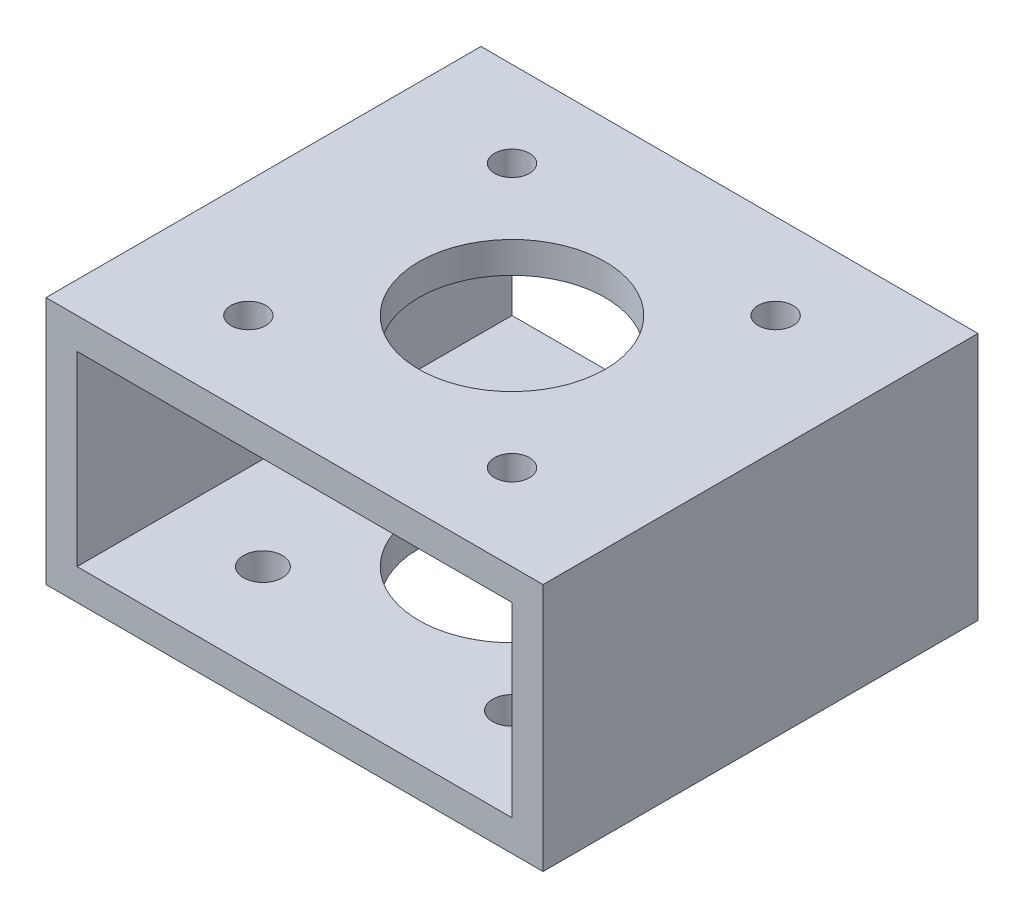
ISO-10303-21;
HEADER;
FILE_DESCRIPTION(('STEP AP214'),'2;1');
FILE_NAME('part.step','',(''),(''),'','','');
FILE_SCHEMA(('AUTOMOTIVE_DESIGN { 1 0 10303 214 1 1 1 1 }'));
ENDSEC;
DATA;
#1=APPLICATION_CONTEXT('core data for automotive mechanical design processes');
#2=APPLICATION_PROTOCOL_DEFINITION('international standard','automotive_design',2000,#1);
#3=PRODUCT_CONTEXT('',#1,'mechanical');
#4=PRODUCT('Part','Part','',(#3));
#5=PRODUCT_RELATED_PRODUCT_CATEGORY('part','',(#4));
#6=PRODUCT_DEFINITION_FORMATION('','',#4);
#7=PRODUCT_DEFINITION_CONTEXT('part definition',#1,'design');
#8=PRODUCT_DEFINITION('design','',#6,#7);
#9=PRODUCT_DEFINITION_SHAPE('','',#8);
#10=(LENGTH_UNIT() NAMED_UNIT(*) SI_UNIT(.MILLI.,.METRE.));
#11=(NAMED_UNIT(*) PLANE_ANGLE_UNIT() SI_UNIT($,.RADIAN.));
#12=(NAMED_UNIT(*) SI_UNIT($,.STERADIAN.) SOLID_ANGLE_UNIT());
#13=UNCERTAINTY_MEASURE_WITH_UNIT(LENGTH_MEASURE(1.E-05),#10,'distance_accuracy_value','');
#14=(GEOMETRIC_REPRESENTATION_CONTEXT(3) GLOBAL_UNCERTAINTY_ASSIGNED_CONTEXT((#13)) GLOBAL_UNIT_ASSIGNED_CONTEXT((#10,
#11,#12)) REPRESENTATION_CONTEXT('',''));
#15=CARTESIAN_POINT('',(0.,0.,0.));
#16=DIRECTION('',(0.,0.,1.));
#17=DIRECTION('',(1.,0.,0.));
#18=AXIS2_PLACEMENT_3D('',#15,#16,#17);
#19=CARTESIAN_POINT('',(0.,0.,0.));
#20=DIRECTION('',(0.,1.,0.));
#21=DIRECTION('',(-1.,0.,0.));
#22=AXIS2_PLACEMENT_3D('',#19,#20,#21);
#23=CYLINDRICAL_SURFACE('',#22,9.525);
#24=CARTESIAN_POINT('',(0.,3.175,0.));
#25=DIRECTION('',(0.,-1.,0.));
#26=DIRECTION('',(1.,0.,0.));
#27=AXIS2_PLACEMENT_3D('',#24,#25,#26);
#28=CIRCLE('',#27,9.525);
#29=CARTESIAN_POINT('',(9.525,3.175,0.));
#30=VERTEX_POINT('',#29);
#31=EDGE_CURVE('E45',#30,#30,#28,.F.);
#32=ORIENTED_EDGE('',*,*,#31,.T.);
#33=EDGE_LOOP('',(#32));
#34=FACE_BOUND('',#33,.T.);
#35=CARTESIAN_POINT('',(0.,0.,0.));
#36=DIRECTION('',(0.,1.,0.));
#37=DIRECTION('',(-1.,0.,0.));
#38=AXIS2_PLACEMENT_3D('',#35,#36,#37);
#39=CIRCLE('',#38,9.525);
#40=CARTESIAN_POINT('',(-9.525,0.,0.));
#41=VERTEX_POINT('',#40);
#42=EDGE_CURVE('E162',#41,#41,#39,.T.);
#43=ORIENTED_EDGE('',*,*,#42,.F.);
#44=EDGE_LOOP('',(#43));
#45=FACE_BOUND('',#44,.T.);
#46=ADVANCED_FACE('F41',(#34,#45),#23,.F.);
#47=CARTESIAN_POINT('',(-25.4,25.4,22.225));
#48=DIRECTION('',(1.,0.,0.));
#49=DIRECTION('',(0.,0.,-1.));
#50=AXIS2_PLACEMENT_3D('',#47,#48,#49);
#51=PLANE('',#50);
#52=DIRECTION('',(0.,-1.,0.));
#53=VECTOR('',#52,1.);
#54=CARTESIAN_POINT('',(-25.4,25.4,-22.225));
#55=LINE('',#54,#53);
#56=CARTESIAN_POINT('',(-25.4,25.4,-22.225));
#57=VERTEX_POINT('',#56);
#58=CARTESIAN_POINT('',(-25.4,0.,-22.225));
#59=VERTEX_POINT('',#58);
#60=EDGE_CURVE('E166',#57,#59,#55,.T.);
#61=ORIENTED_EDGE('',*,*,#60,.T.);
#62=DIRECTION('',(0.,0.,-1.));
#63=VECTOR('',#62,1.);
#64=CARTESIAN_POINT('',(-25.4,0.,22.225));
#65=LINE('',#64,#63);
#66=CARTESIAN_POINT('',(-25.4,0.,22.225));
#67=VERTEX_POINT('',#66);
#68=EDGE_CURVE('E11',#67,#59,#65,.T.);
#69=ORIENTED_EDGE('',*,*,#68,.F.);
#70=DIRECTION('',(0.,-1.,0.));
#71=VECTOR('',#70,1.);
#72=CARTESIAN_POINT('',(-25.4,25.4,22.225));
#73=LINE('',#72,#71);
#74=CARTESIAN_POINT('',(-25.4,25.4,22.225));
#75=VERTEX_POINT('',#74);
#76=EDGE_CURVE('E171',#75,#67,#73,.T.);
#77=ORIENTED_EDGE('',*,*,#76,.F.);
#78=DIRECTION('',(0.,0.,-1.));
#79=VECTOR('',#78,1.);
#80=CARTESIAN_POINT('',(-25.4,25.4,22.225));
#81=LINE('',#80,#79);
#82=EDGE_CURVE('E185',#75,#57,#81,.T.);
#83=ORIENTED_EDGE('',*,*,#82,.T.);
#84=EDGE_LOOP('',(#61,#69,#77,#83));
#85=FACE_BOUND('',#84,.T.);
#86=ADVANCED_FACE('F43',(#85),#51,.F.);
#87=CARTESIAN_POINT('',(-25.4,0.,22.225));
#88=DIRECTION('',(0.,1.,0.));
#89=DIRECTION('',(-1.,0.,0.));
#90=AXIS2_PLACEMENT_3D('',#87,#88,#89);
#91=PLANE('',#90);
#92=CARTESIAN_POINT('',(12.7279220613579,0.,-12.7279220613578));
#93=DIRECTION('',(0.,-1.,0.));
#94=DIRECTION('',(0.,0.,-1.));
#95=AXIS2_PLACEMENT_3D('',#92,#93,#94);
#96=CIRCLE('',#95,1.984375);
#97=CARTESIAN_POINT('',(12.7279220613579,0.,-14.7122970613578));
#98=VERTEX_POINT('',#97);
#99=EDGE_CURVE('E260',#98,#98,#96,.T.);
#100=ORIENTED_EDGE('',*,*,#99,.F.);
#101=EDGE_LOOP('',(#100));
#102=FACE_BOUND('',#101,.T.);
#103=CARTESIAN_POINT('',(-12.7279220613578,0.,-12.7279220613579));
#104=DIRECTION('',(0.,-1.,0.));
#105=DIRECTION('',(0.,0.,-1.));
#106=AXIS2_PLACEMENT_3D('',#103,#104,#105);
#107=CIRCLE('',#106,1.984375);
#108=CARTESIAN_POINT('',(-12.7279220613578,0.,-14.7122970613579));
#109=VERTEX_POINT('',#108);
#110=EDGE_CURVE('E264',#109,#109,#107,.T.);
#111=ORIENTED_EDGE('',*,*,#110,.F.);
#112=EDGE_LOOP('',(#111));
#113=FACE_BOUND('',#112,.T.);
#114=CARTESIAN_POINT('',(-12.7279220613579,0.,12.7279220613578));
#115=DIRECTION('',(0.,-1.,0.));
#116=DIRECTION('',(0.,0.,-1.));
#117=AXIS2_PLACEMENT_3D('',#114,#115,#116);
#118=CIRCLE('',#117,1.984375);
#119=CARTESIAN_POINT('',(-12.7279220613579,0.,10.7435470613578));
#120=VERTEX_POINT('',#119);
#121=EDGE_CURVE('E268',#120,#120,#118,.T.);
#122=ORIENTED_EDGE('',*,*,#121,.F.);
#123=EDGE_LOOP('',(#122));
#124=FACE_BOUND('',#123,.T.);
#125=CARTESIAN_POINT('',(12.7279220613578,0.,12.7279220613579));
#126=DIRECTION('',(0.,-1.,0.));
#127=DIRECTION('',(0.,0.,-1.));
#128=AXIS2_PLACEMENT_3D('',#125,#126,#127);
#129=CIRCLE('',#128,1.984375);
#130=CARTESIAN_POINT('',(12.7279220613578,0.,10.7435470613579));
#131=VERTEX_POINT('',#130);
#132=EDGE_CURVE('E272',#131,#131,#129,.T.);
#133=ORIENTED_EDGE('',*,*,#132,.F.);
#134=EDGE_LOOP('',(#133));
#135=FACE_BOUND('',#134,.T.);
#136=ORIENTED_EDGE('',*,*,#42,.T.);
#137=EDGE_LOOP('',(#136));
#138=FACE_BOUND('',#137,.T.);
#139=DIRECTION('',(1.,0.,0.));
#140=VECTOR('',#139,1.);
#141=CARTESIAN_POINT('',(-25.4,0.,-22.225));
#142=LINE('',#141,#140);
#143=CARTESIAN_POINT('',(25.4,0.,-22.225));
#144=VERTEX_POINT('',#143);
#145=EDGE_CURVE('E189',#59,#144,#142,.T.);
#146=ORIENTED_EDGE('',*,*,#145,.T.);
#147=DIRECTION('',(0.,0.,-1.));
#148=VECTOR('',#147,1.);
#149=CARTESIAN_POINT('',(25.4,0.,22.225));
#150=LINE('',#149,#148);
#151=CARTESIAN_POINT('',(25.4,0.,22.225));
#152=VERTEX_POINT('',#151);
#153=EDGE_CURVE('E51',#152,#144,#150,.T.);
#154=ORIENTED_EDGE('',*,*,#153,.F.);
#155=DIRECTION('',(1.,0.,0.));
#156=VECTOR('',#155,1.);
#157=CARTESIAN_POINT('',(-25.4,0.,22.225));
#158=LINE('',#157,#156);
#159=EDGE_CURVE('E175',#67,#152,#158,.T.);
#160=ORIENTED_EDGE('',*,*,#159,.F.);
#161=ORIENTED_EDGE('',*,*,#68,.T.);
#162=EDGE_LOOP('',(#146,#154,#160,#161));
#163=FACE_BOUND('',#162,.T.);
#164=ADVANCED_FACE('F237',(#102,#113,#124,#135,#138,#163),#91,.F.);
#165=CARTESIAN_POINT('',(25.4,25.4,22.225));
#166=DIRECTION('',(-1.,0.,0.));
#167=DIRECTION('',(0.,-1.,0.));
#168=AXIS2_PLACEMENT_3D('',#165,#166,#167);
#169=PLANE('',#168);
#170=DIRECTION('',(0.,1.,0.));
#171=VECTOR('',#170,1.);
#172=CARTESIAN_POINT('',(25.4,25.4,-22.225));
#173=LINE('',#172,#171);
#174=CARTESIAN_POINT('',(25.4,25.4,-22.225));
#175=VERTEX_POINT('',#174);
#176=EDGE_CURVE('E192',#144,#175,#173,.T.);
#177=ORIENTED_EDGE('',*,*,#176,.T.);
#178=DIRECTION('',(0.,0.,-1.));
#179=VECTOR('',#178,1.);
#180=CARTESIAN_POINT('',(25.4,25.4,22.225));
#181=LINE('',#180,#179);
#182=CARTESIAN_POINT('',(25.4,25.4,22.225));
#183=VERTEX_POINT('',#182);
#184=EDGE_CURVE('E200',#183,#175,#181,.T.);
#185=ORIENTED_EDGE('',*,*,#184,.F.);
#186=DIRECTION('',(0.,1.,0.));
#187=VECTOR('',#186,1.);
#188=CARTESIAN_POINT('',(25.4,25.4,22.225));
#189=LINE('',#188,#187);
#190=EDGE_CURVE('E179',#152,#183,#189,.T.);
#191=ORIENTED_EDGE('',*,*,#190,.F.);
#192=ORIENTED_EDGE('',*,*,#153,.T.);
#193=EDGE_LOOP('',(#177,#185,#191,#192));
#194=FACE_BOUND('',#193,.T.);
#195=ADVANCED_FACE('F249',(#194),#169,.F.);
#196=CARTESIAN_POINT('',(-25.4,25.4,22.225));
#197=DIRECTION('',(0.,-1.,0.));
#198=DIRECTION('',(1.,0.,0.));
#199=AXIS2_PLACEMENT_3D('',#196,#197,#198);
#200=PLANE('',#199);
#201=CARTESIAN_POINT('',(-13.4703841816038,25.4,-13.4703841816037));
#202=DIRECTION('',(0.,1.,0.));
#203=DIRECTION('',(0.,0.,1.));
#204=AXIS2_PLACEMENT_3D('',#201,#202,#203);
#205=CIRCLE('',#204,1.786001);
#206=CARTESIAN_POINT('',(-13.4703841816038,25.4,-11.6843831816037));
#207=VERTEX_POINT('',#206);
#208=EDGE_CURVE('E295',#207,#207,#205,.T.);
#209=ORIENTED_EDGE('',*,*,#208,.F.);
#210=EDGE_LOOP('',(#209));
#211=FACE_BOUND('',#210,.T.);
#212=CARTESIAN_POINT('',(13.4703841816037,25.4,-13.4703841816038));
#213=DIRECTION('',(0.,1.,0.));
#214=DIRECTION('',(0.,0.,1.));
#215=AXIS2_PLACEMENT_3D('',#212,#213,#214);
#216=CIRCLE('',#215,1.786001);
#217=CARTESIAN_POINT('',(13.4703841816037,25.4,-11.6843831816038));
#218=VERTEX_POINT('',#217);
#219=EDGE_CURVE('E308',#218,#218,#216,.T.);
#220=ORIENTED_EDGE('',*,*,#219,.F.);
#221=EDGE_LOOP('',(#220));
#222=FACE_BOUND('',#221,.T.);
#223=CARTESIAN_POINT('',(13.4703841816038,25.4,13.4703841816037));
#224=DIRECTION('',(0.,1.,0.));
#225=DIRECTION('',(0.,0.,1.));
#226=AXIS2_PLACEMENT_3D('',#223,#224,#225);
#227=CIRCLE('',#226,1.786001);
#228=CARTESIAN_POINT('',(13.4703841816038,25.4,15.2563851816037));
#229=VERTEX_POINT('',#228);
#230=EDGE_CURVE('E316',#229,#229,#227,.T.);
#231=ORIENTED_EDGE('',*,*,#230,.F.);
#232=EDGE_LOOP('',(#231));
#233=FACE_BOUND('',#232,.T.);
#234=CARTESIAN_POINT('',(-13.4703841816037,25.4,13.4703841816038));
#235=DIRECTION('',(0.,1.,0.));
#236=DIRECTION('',(0.,0.,1.));
#237=AXIS2_PLACEMENT_3D('',#234,#235,#236);
#238=CIRCLE('',#237,1.786001);
#239=CARTESIAN_POINT('',(-13.4703841816037,25.4,15.2563851816038));
#240=VERTEX_POINT('',#239);
#241=EDGE_CURVE('E323',#240,#240,#238,.T.);
#242=ORIENTED_EDGE('',*,*,#241,.F.);
#243=EDGE_LOOP('',(#242));
#244=FACE_BOUND('',#243,.T.);
#245=CARTESIAN_POINT('',(0.,25.4,0.));
#246=DIRECTION('',(0.,1.,0.));
#247=DIRECTION('',(-1.,0.,0.));
#248=AXIS2_PLACEMENT_3D('',#245,#246,#247);
#249=CIRCLE('',#248,9.525);
#250=CARTESIAN_POINT('',(-9.52500000000001,25.4,0.));
#251=VERTEX_POINT('',#250);
#252=EDGE_CURVE('E167',#251,#251,#249,.T.);
#253=ORIENTED_EDGE('',*,*,#252,.F.);
#254=EDGE_LOOP('',(#253));
#255=FACE_BOUND('',#254,.T.);
#256=DIRECTION('',(-1.,0.,0.));
#257=VECTOR('',#256,1.);
#258=CARTESIAN_POINT('',(-25.4,25.4,-22.225));
#259=LINE('',#258,#257);
#260=EDGE_CURVE('E176',#175,#57,#259,.T.);
#261=ORIENTED_EDGE('',*,*,#260,.T.);
#262=ORIENTED_EDGE('',*,*,#82,.F.);
#263=DIRECTION('',(-1.,0.,0.));
#264=VECTOR('',#263,1.);
#265=CARTESIAN_POINT('',(-25.4,25.4,22.225));
#266=LINE('',#265,#264);
#267=EDGE_CURVE('E182',#183,#75,#266,.T.);
#268=ORIENTED_EDGE('',*,*,#267,.F.);
#269=ORIENTED_EDGE('',*,*,#184,.T.);
#270=EDGE_LOOP('',(#261,#262,#268,#269));
#271=FACE_BOUND('',#270,.T.);
#272=ADVANCED_FACE('F243',(#211,#222,#233,#244,#255,#271),#200,.F.);
#273=CARTESIAN_POINT('',(0.,0.,22.225));
#274=DIRECTION('',(0.,0.,1.));
#275=DIRECTION('',(1.,0.,0.));
#276=AXIS2_PLACEMENT_3D('',#273,#274,#275);
#277=PLANE('',#276);
#278=DIRECTION('',(0.,1.,0.));
#279=VECTOR('',#278,1.);
#280=CARTESIAN_POINT('',(-22.225,3.175,22.225));
#281=LINE('',#280,#279);
#282=CARTESIAN_POINT('',(-22.225,3.175,22.225));
#283=VERTEX_POINT('',#282);
#284=CARTESIAN_POINT('',(-22.225,22.225,22.225));
#285=VERTEX_POINT('',#284);
#286=EDGE_CURVE('E111',#283,#285,#281,.T.);
#287=ORIENTED_EDGE('',*,*,#286,.T.);
#288=DIRECTION('',(1.,0.,0.));
#289=VECTOR('',#288,1.);
#290=CARTESIAN_POINT('',(-22.225,22.225,22.225));
#291=LINE('',#290,#289);
#292=CARTESIAN_POINT('',(22.225,22.225,22.225));
#293=VERTEX_POINT('',#292);
#294=EDGE_CURVE('E121',#285,#293,#291,.T.);
#295=ORIENTED_EDGE('',*,*,#294,.T.);
#296=DIRECTION('',(0.,-1.,0.));
#297=VECTOR('',#296,1.);
#298=CARTESIAN_POINT('',(22.225,3.17499999999999,22.225));
#299=LINE('',#298,#297);
#300=CARTESIAN_POINT('',(22.225,3.17499999999999,22.225));
#301=VERTEX_POINT('',#300);
#302=EDGE_CURVE('E59',#293,#301,#299,.T.);
#303=ORIENTED_EDGE('',*,*,#302,.T.);
#304=DIRECTION('',(-1.,0.,0.));
#305=VECTOR('',#304,1.);
#306=CARTESIAN_POINT('',(-22.225,3.175,22.225));
#307=LINE('',#306,#305);
#308=EDGE_CURVE('E118',#301,#283,#307,.T.);
#309=ORIENTED_EDGE('',*,*,#308,.T.);
#310=EDGE_LOOP('',(#287,#295,#303,#309));
#311=FACE_BOUND('',#310,.T.);
#312=ORIENTED_EDGE('',*,*,#76,.T.);
#313=ORIENTED_EDGE('',*,*,#159,.T.);
#314=ORIENTED_EDGE('',*,*,#190,.T.);
#315=ORIENTED_EDGE('',*,*,#267,.T.);
#316=EDGE_LOOP('',(#312,#313,#314,#315));
#317=FACE_BOUND('',#316,.T.);
#318=ADVANCED_FACE('F127',(#311,#317),#277,.T.);
#319=CARTESIAN_POINT('',(0.,0.,-22.225));
#320=DIRECTION('',(0.,0.,1.));
#321=DIRECTION('',(1.,0.,0.));
#322=AXIS2_PLACEMENT_3D('',#319,#320,#321);
#323=PLANE('',#322);
#324=DIRECTION('',(1.,0.,0.));
#325=VECTOR('',#324,1.);
#326=CARTESIAN_POINT('',(-22.225,22.225,-22.225));
#327=LINE('',#326,#325);
#328=CARTESIAN_POINT('',(-22.225,22.225,-22.225));
#329=VERTEX_POINT('',#328);
#330=CARTESIAN_POINT('',(22.225,22.225,-22.225));
#331=VERTEX_POINT('',#330);
#332=EDGE_CURVE('E147',#329,#331,#327,.T.);
#333=ORIENTED_EDGE('',*,*,#332,.F.);
#334=DIRECTION('',(0.,1.,0.));
#335=VECTOR('',#334,1.);
#336=CARTESIAN_POINT('',(-22.225,3.175,-22.225));
#337=LINE('',#336,#335);
#338=CARTESIAN_POINT('',(-22.225,3.175,-22.225));
#339=VERTEX_POINT('',#338);
#340=EDGE_CURVE('E67',#339,#329,#337,.T.);
#341=ORIENTED_EDGE('',*,*,#340,.F.);
#342=DIRECTION('',(-1.,0.,0.));
#343=VECTOR('',#342,1.);
#344=CARTESIAN_POINT('',(-22.225,3.175,-22.225));
#345=LINE('',#344,#343);
#346=CARTESIAN_POINT('',(22.225,3.17499999999999,-22.225));
#347=VERTEX_POINT('',#346);
#348=EDGE_CURVE('E131',#347,#339,#345,.T.);
#349=ORIENTED_EDGE('',*,*,#348,.F.);
#350=DIRECTION('',(0.,-1.,0.));
#351=VECTOR('',#350,1.);
#352=CARTESIAN_POINT('',(22.225,3.17499999999999,-22.225));
#353=LINE('',#352,#351);
#354=EDGE_CURVE('E135',#331,#347,#353,.T.);
#355=ORIENTED_EDGE('',*,*,#354,.F.);
#356=EDGE_LOOP('',(#333,#341,#349,#355));
#357=FACE_BOUND('',#356,.T.);
#358=ORIENTED_EDGE('',*,*,#60,.F.);
#359=ORIENTED_EDGE('',*,*,#260,.F.);
#360=ORIENTED_EDGE('',*,*,#176,.F.);
#361=ORIENTED_EDGE('',*,*,#145,.F.);
#362=EDGE_LOOP('',(#358,#359,#360,#361));
#363=FACE_BOUND('',#362,.T.);
#364=ADVANCED_FACE('F227',(#357,#363),#323,.F.);
#365=CARTESIAN_POINT('',(0.,22.225,0.));
#366=DIRECTION('',(0.,1.,0.));
#367=DIRECTION('',(-1.,0.,0.));
#368=AXIS2_PLACEMENT_3D('',#365,#366,#367);
#369=CIRCLE('',#368,9.525);
#370=CARTESIAN_POINT('',(-9.52500000000001,22.225,0.));
#371=VERTEX_POINT('',#370);
#372=EDGE_CURVE('E156',#371,#371,#369,.F.);
#373=ORIENTED_EDGE('',*,*,#372,.T.);
#374=EDGE_LOOP('',(#373));
#375=FACE_BOUND('',#374,.T.);
#376=ORIENTED_EDGE('',*,*,#252,.T.);
#377=EDGE_LOOP('',(#376));
#378=FACE_BOUND('',#377,.T.);
#379=ADVANCED_FACE('F218',(#375,#378),#23,.F.);
#380=CARTESIAN_POINT('',(-22.225,3.175,22.225));
#381=DIRECTION('',(0.,-1.,0.));
#382=DIRECTION('',(1.,0.,0.));
#383=AXIS2_PLACEMENT_3D('',#380,#381,#382);
#384=PLANE('',#383);
#385=CARTESIAN_POINT('',(12.7279220613579,3.175,-12.7279220613578));
#386=DIRECTION('',(0.,-1.,0.));
#387=DIRECTION('',(1.,0.,0.));
#388=AXIS2_PLACEMENT_3D('',#385,#386,#387);
#389=CIRCLE('',#388,1.984375);
#390=CARTESIAN_POINT('',(14.7122970613579,3.17499999999999,-12.7279220613578));
#391=VERTEX_POINT('',#390);
#392=EDGE_CURVE('E371',#391,#391,#389,.T.);
#393=ORIENTED_EDGE('',*,*,#392,.T.);
#394=EDGE_LOOP('',(#393));
#395=FACE_BOUND('',#394,.T.);
#396=CARTESIAN_POINT('',(-12.7279220613578,3.175,-12.7279220613579));
#397=DIRECTION('',(0.,-1.,0.));
#398=DIRECTION('',(1.,0.,0.));
#399=AXIS2_PLACEMENT_3D('',#396,#397,#398);
#400=CIRCLE('',#399,1.984375);
#401=CARTESIAN_POINT('',(-10.7435470613578,3.175,-12.7279220613579));
#402=VERTEX_POINT('',#401);
#403=EDGE_CURVE('E379',#402,#402,#400,.T.);
#404=ORIENTED_EDGE('',*,*,#403,.T.);
#405=EDGE_LOOP('',(#404));
#406=FACE_BOUND('',#405,.T.);
#407=CARTESIAN_POINT('',(-12.7279220613579,3.175,12.7279220613578));
#408=DIRECTION('',(0.,-1.,0.));
#409=DIRECTION('',(1.,0.,0.));
#410=AXIS2_PLACEMENT_3D('',#407,#408,#409);
#411=CIRCLE('',#410,1.984375);
#412=CARTESIAN_POINT('',(-10.7435470613579,3.175,12.7279220613578));
#413=VERTEX_POINT('',#412);
#414=EDGE_CURVE('E290',#413,#413,#411,.T.);
#415=ORIENTED_EDGE('',*,*,#414,.T.);
#416=EDGE_LOOP('',(#415));
#417=FACE_BOUND('',#416,.T.);
#418=CARTESIAN_POINT('',(12.7279220613578,3.175,12.7279220613579));
#419=DIRECTION('',(0.,-1.,0.));
#420=DIRECTION('',(1.,0.,0.));
#421=AXIS2_PLACEMENT_3D('',#418,#419,#420);
#422=CIRCLE('',#421,1.984375);
#423=CARTESIAN_POINT('',(14.7122970613578,3.17499999999999,12.7279220613579));
#424=VERTEX_POINT('',#423);
#425=EDGE_CURVE('E289',#424,#424,#422,.T.);
#426=ORIENTED_EDGE('',*,*,#425,.T.);
#427=EDGE_LOOP('',(#426));
#428=FACE_BOUND('',#427,.T.);
#429=ORIENTED_EDGE('',*,*,#348,.T.);
#430=DIRECTION('',(0.,0.,-1.));
#431=VECTOR('',#430,1.);
#432=CARTESIAN_POINT('',(-22.225,3.175,22.225));
#433=LINE('',#432,#431);
#434=EDGE_CURVE('E153',#283,#339,#433,.T.);
#435=ORIENTED_EDGE('',*,*,#434,.F.);
#436=ORIENTED_EDGE('',*,*,#308,.F.);
#437=DIRECTION('',(0.,0.,-1.));
#438=VECTOR('',#437,1.);
#439=CARTESIAN_POINT('',(22.225,3.17499999999999,22.225));
#440=LINE('',#439,#438);
#441=EDGE_CURVE('E157',#301,#347,#440,.T.);
#442=ORIENTED_EDGE('',*,*,#441,.T.);
#443=EDGE_LOOP('',(#429,#435,#436,#442));
#444=FACE_BOUND('',#443,.T.);
#445=ORIENTED_EDGE('',*,*,#31,.F.);
#446=EDGE_LOOP('',(#445));
#447=FACE_BOUND('',#446,.T.);
#448=ADVANCED_FACE('F216',(#395,#406,#417,#428,#444,#447),#384,.F.);
#449=CARTESIAN_POINT('',(-22.225,22.225,22.225));
#450=DIRECTION('',(0.,1.,0.));
#451=DIRECTION('',(-1.,0.,0.));
#452=AXIS2_PLACEMENT_3D('',#449,#450,#451);
#453=PLANE('',#452);
#454=CARTESIAN_POINT('',(-13.4703841816038,22.225,-13.4703841816037));
#455=DIRECTION('',(0.,1.,0.));
#456=DIRECTION('',(-1.,0.,0.));
#457=AXIS2_PLACEMENT_3D('',#454,#455,#456);
#458=CIRCLE('',#457,1.786001);
#459=CARTESIAN_POINT('',(-15.2563851816038,22.225,-13.4703841816037));
#460=VERTEX_POINT('',#459);
#461=EDGE_CURVE('E304',#460,#460,#458,.T.);
#462=ORIENTED_EDGE('',*,*,#461,.T.);
#463=EDGE_LOOP('',(#462));
#464=FACE_BOUND('',#463,.T.);
#465=CARTESIAN_POINT('',(13.4703841816037,22.225,-13.4703841816038));
#466=DIRECTION('',(0.,1.,0.));
#467=DIRECTION('',(-1.,0.,0.));
#468=AXIS2_PLACEMENT_3D('',#465,#466,#467);
#469=CIRCLE('',#468,1.786001);
#470=CARTESIAN_POINT('',(11.6843831816037,22.225,-13.4703841816038));
#471=VERTEX_POINT('',#470);
#472=EDGE_CURVE('E312',#471,#471,#469,.T.);
#473=ORIENTED_EDGE('',*,*,#472,.T.);
#474=EDGE_LOOP('',(#473));
#475=FACE_BOUND('',#474,.T.);
#476=CARTESIAN_POINT('',(13.4703841816038,22.225,13.4703841816037));
#477=DIRECTION('',(0.,1.,0.));
#478=DIRECTION('',(-1.,0.,0.));
#479=AXIS2_PLACEMENT_3D('',#476,#477,#478);
#480=CIRCLE('',#479,1.786001);
#481=CARTESIAN_POINT('',(11.6843831816038,22.225,13.4703841816037));
#482=VERTEX_POINT('',#481);
#483=EDGE_CURVE('E320',#482,#482,#480,.T.);
#484=ORIENTED_EDGE('',*,*,#483,.T.);
#485=EDGE_LOOP('',(#484));
#486=FACE_BOUND('',#485,.T.);
#487=CARTESIAN_POINT('',(-13.4703841816037,22.225,13.4703841816038));
#488=DIRECTION('',(0.,1.,0.));
#489=DIRECTION('',(-1.,0.,0.));
#490=AXIS2_PLACEMENT_3D('',#487,#488,#489);
#491=CIRCLE('',#490,1.786001);
#492=CARTESIAN_POINT('',(-15.2563851816037,22.225,13.4703841816038));
#493=VERTEX_POINT('',#492);
#494=EDGE_CURVE('E138',#493,#493,#491,.T.);
#495=ORIENTED_EDGE('',*,*,#494,.T.);
#496=EDGE_LOOP('',(#495));
#497=FACE_BOUND('',#496,.T.);
#498=ORIENTED_EDGE('',*,*,#332,.T.);
#499=DIRECTION('',(0.,0.,-1.));
#500=VECTOR('',#499,1.);
#501=CARTESIAN_POINT('',(22.225,22.225,22.225));
#502=LINE('',#501,#500);
#503=EDGE_CURVE('E117',#293,#331,#502,.T.);
#504=ORIENTED_EDGE('',*,*,#503,.F.);
#505=ORIENTED_EDGE('',*,*,#294,.F.);
#506=DIRECTION('',(0.,0.,-1.));
#507=VECTOR('',#506,1.);
#508=CARTESIAN_POINT('',(-22.225,22.225,22.225));
#509=LINE('',#508,#507);
#510=EDGE_CURVE('E107',#285,#329,#509,.T.);
#511=ORIENTED_EDGE('',*,*,#510,.T.);
#512=EDGE_LOOP('',(#498,#504,#505,#511));
#513=FACE_BOUND('',#512,.T.);
#514=ORIENTED_EDGE('',*,*,#372,.F.);
#515=EDGE_LOOP('',(#514));
#516=FACE_BOUND('',#515,.T.);
#517=ADVANCED_FACE('F122',(#464,#475,#486,#497,#513,#516),#453,.F.);
#518=CARTESIAN_POINT('',(-22.225,3.175,22.225));
#519=DIRECTION('',(-1.,0.,0.));
#520=DIRECTION('',(0.,0.,1.));
#521=AXIS2_PLACEMENT_3D('',#518,#519,#520);
#522=PLANE('',#521);
#523=ORIENTED_EDGE('',*,*,#340,.T.);
#524=ORIENTED_EDGE('',*,*,#510,.F.);
#525=ORIENTED_EDGE('',*,*,#286,.F.);
#526=ORIENTED_EDGE('',*,*,#434,.T.);
#527=EDGE_LOOP('',(#523,#524,#525,#526));
#528=FACE_BOUND('',#527,.T.);
#529=ADVANCED_FACE('F109',(#528),#522,.F.);
#530=CARTESIAN_POINT('',(22.225,3.17499999999999,22.225));
#531=DIRECTION('',(1.,0.,0.));
#532=DIRECTION('',(0.,0.,-1.));
#533=AXIS2_PLACEMENT_3D('',#530,#531,#532);
#534=PLANE('',#533);
#535=ORIENTED_EDGE('',*,*,#354,.T.);
#536=ORIENTED_EDGE('',*,*,#441,.F.);
#537=ORIENTED_EDGE('',*,*,#302,.F.);
#538=ORIENTED_EDGE('',*,*,#503,.T.);
#539=EDGE_LOOP('',(#535,#536,#537,#538));
#540=FACE_BOUND('',#539,.T.);
#541=ADVANCED_FACE('F336',(#540),#534,.F.);
#542=CARTESIAN_POINT('',(-13.4703841816037,25.4,13.4703841816038));
#543=DIRECTION('',(0.,1.,0.));
#544=DIRECTION('',(0.,0.,1.));
#545=AXIS2_PLACEMENT_3D('',#542,#543,#544);
#546=CYLINDRICAL_SURFACE('',#545,1.786001);
#547=ORIENTED_EDGE('',*,*,#494,.F.);
#548=EDGE_LOOP('',(#547));
#549=FACE_BOUND('',#548,.T.);
#550=ORIENTED_EDGE('',*,*,#241,.T.);
#551=EDGE_LOOP('',(#550));
#552=FACE_BOUND('',#551,.T.);
#553=ADVANCED_FACE('F333',(#549,#552),#546,.F.);
#554=CARTESIAN_POINT('',(13.4703841816038,25.4,13.4703841816037));
#555=DIRECTION('',(0.,1.,0.));
#556=DIRECTION('',(0.,0.,1.));
#557=AXIS2_PLACEMENT_3D('',#554,#555,#556);
#558=CYLINDRICAL_SURFACE('',#557,1.786001);
#559=ORIENTED_EDGE('',*,*,#483,.F.);
#560=EDGE_LOOP('',(#559));
#561=FACE_BOUND('',#560,.T.);
#562=ORIENTED_EDGE('',*,*,#230,.T.);
#563=EDGE_LOOP('',(#562));
#564=FACE_BOUND('',#563,.T.);
#565=ADVANCED_FACE('F335',(#561,#564),#558,.F.);
#566=CARTESIAN_POINT('',(13.4703841816037,25.4,-13.4703841816038));
#567=DIRECTION('',(0.,1.,0.));
#568=DIRECTION('',(0.,0.,1.));
#569=AXIS2_PLACEMENT_3D('',#566,#567,#568);
#570=CYLINDRICAL_SURFACE('',#569,1.786001);
#571=ORIENTED_EDGE('',*,*,#472,.F.);
#572=EDGE_LOOP('',(#571));
#573=FACE_BOUND('',#572,.T.);
#574=ORIENTED_EDGE('',*,*,#219,.T.);
#575=EDGE_LOOP('',(#574));
#576=FACE_BOUND('',#575,.T.);
#577=ADVANCED_FACE('F341',(#573,#576),#570,.F.);
#578=CARTESIAN_POINT('',(-13.4703841816038,25.4,-13.4703841816037));
#579=DIRECTION('',(0.,1.,0.));
#580=DIRECTION('',(0.,0.,1.));
#581=AXIS2_PLACEMENT_3D('',#578,#579,#580);
#582=CYLINDRICAL_SURFACE('',#581,1.786001);
#583=ORIENTED_EDGE('',*,*,#461,.F.);
#584=EDGE_LOOP('',(#583));
#585=FACE_BOUND('',#584,.T.);
#586=ORIENTED_EDGE('',*,*,#208,.T.);
#587=EDGE_LOOP('',(#586));
#588=FACE_BOUND('',#587,.T.);
#589=ADVANCED_FACE('F347',(#585,#588),#582,.F.);
#590=CARTESIAN_POINT('',(12.7279220613578,0.,12.7279220613579));
#591=DIRECTION('',(0.,-1.,0.));
#592=DIRECTION('',(0.,0.,-1.));
#593=AXIS2_PLACEMENT_3D('',#590,#591,#592);
#594=CYLINDRICAL_SURFACE('',#593,1.984375);
#595=ORIENTED_EDGE('',*,*,#425,.F.);
#596=EDGE_LOOP('',(#595));
#597=FACE_BOUND('',#596,.T.);
#598=ORIENTED_EDGE('',*,*,#132,.T.);
#599=EDGE_LOOP('',(#598));
#600=FACE_BOUND('',#599,.T.);
#601=ADVANCED_FACE('F351',(#597,#600),#594,.F.);
#602=CARTESIAN_POINT('',(-12.7279220613579,0.,12.7279220613578));
#603=DIRECTION('',(0.,-1.,0.));
#604=DIRECTION('',(0.,0.,-1.));
#605=AXIS2_PLACEMENT_3D('',#602,#603,#604);
#606=CYLINDRICAL_SURFACE('',#605,1.984375);
#607=ORIENTED_EDGE('',*,*,#414,.F.);
#608=EDGE_LOOP('',(#607));
#609=FACE_BOUND('',#608,.T.);
#610=ORIENTED_EDGE('',*,*,#121,.T.);
#611=EDGE_LOOP('',(#610));
#612=FACE_BOUND('',#611,.T.);
#613=ADVANCED_FACE('F355',(#609,#612),#606,.F.);
#614=CARTESIAN_POINT('',(-12.7279220613578,0.,-12.7279220613579));
#615=DIRECTION('',(0.,-1.,0.));
#616=DIRECTION('',(0.,0.,-1.));
#617=AXIS2_PLACEMENT_3D('',#614,#615,#616);
#618=CYLINDRICAL_SURFACE('',#617,1.984375);
#619=ORIENTED_EDGE('',*,*,#403,.F.);
#620=EDGE_LOOP('',(#619));
#621=FACE_BOUND('',#620,.T.);
#622=ORIENTED_EDGE('',*,*,#110,.T.);
#623=EDGE_LOOP('',(#622));
#624=FACE_BOUND('',#623,.T.);
#625=ADVANCED_FACE('F359',(#621,#624),#618,.F.);
#626=CARTESIAN_POINT('',(12.7279220613579,0.,-12.7279220613578));
#627=DIRECTION('',(0.,-1.,0.));
#628=DIRECTION('',(0.,0.,-1.));
#629=AXIS2_PLACEMENT_3D('',#626,#627,#628);
#630=CYLINDRICAL_SURFACE('',#629,1.984375);
#631=ORIENTED_EDGE('',*,*,#392,.F.);
#632=EDGE_LOOP('',(#631));
#633=FACE_BOUND('',#632,.T.);
#634=ORIENTED_EDGE('',*,*,#99,.T.);
#635=EDGE_LOOP('',(#634));
#636=FACE_BOUND('',#635,.T.);
#637=ADVANCED_FACE('F363',(#633,#636),#630,.F.);
#638=CLOSED_SHELL('',(#46,#86,#164,#195,#272,#318,#364,#379,#448,#517,#529,#541,#553,#565,#577,
#589,#601,#613,#625,#637));
#639=MANIFOLD_SOLID_BREP('B2',#638);
#640=ADVANCED_BREP_SHAPE_REPRESENTATION('',(#18,#639),#14);
#641=SHAPE_DEFINITION_REPRESENTATION(#9,#640);
ENDSEC;
END-ISO-10303-21;
